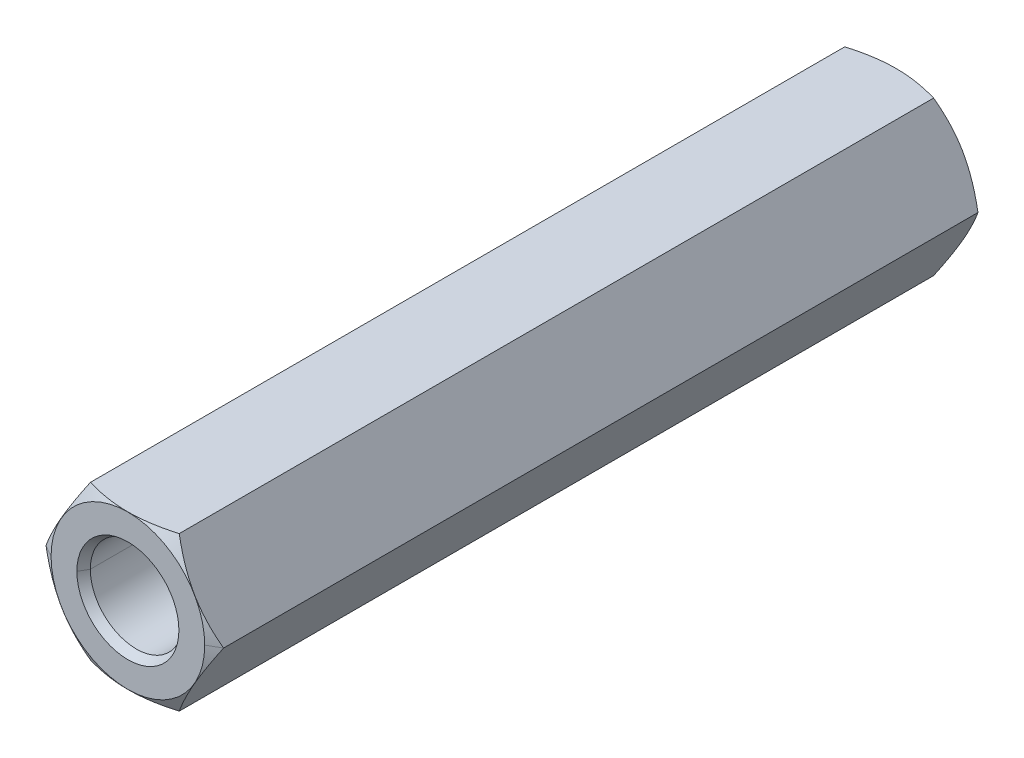
ISO-10303-21;
HEADER;
FILE_DESCRIPTION(('STEP AP214'),'2;1');
FILE_NAME('part.step','',(''),(''),'','','');
FILE_SCHEMA(('AUTOMOTIVE_DESIGN { 1 0 10303 214 1 1 1 1 }'));
ENDSEC;
DATA;
#1=APPLICATION_CONTEXT('core data for automotive mechanical design processes');
#2=APPLICATION_PROTOCOL_DEFINITION('international standard','automotive_design',2000,#1);
#3=PRODUCT_CONTEXT('',#1,'mechanical');
#4=PRODUCT('Part','Part','',(#3));
#5=PRODUCT_RELATED_PRODUCT_CATEGORY('part','',(#4));
#6=PRODUCT_DEFINITION_FORMATION('','',#4);
#7=PRODUCT_DEFINITION_CONTEXT('part definition',#1,'design');
#8=PRODUCT_DEFINITION('design','',#6,#7);
#9=PRODUCT_DEFINITION_SHAPE('','',#8);
#10=(LENGTH_UNIT() NAMED_UNIT(*) SI_UNIT(.MILLI.,.METRE.));
#11=(NAMED_UNIT(*) PLANE_ANGLE_UNIT() SI_UNIT($,.RADIAN.));
#12=(NAMED_UNIT(*) SI_UNIT($,.STERADIAN.) SOLID_ANGLE_UNIT());
#13=UNCERTAINTY_MEASURE_WITH_UNIT(LENGTH_MEASURE(1.E-05),#10,'distance_accuracy_value','');
#14=(GEOMETRIC_REPRESENTATION_CONTEXT(3) GLOBAL_UNCERTAINTY_ASSIGNED_CONTEXT((#13)) GLOBAL_UNIT_ASSIGNED_CONTEXT((#10,
#11,#12)) REPRESENTATION_CONTEXT('',''));
#15=CARTESIAN_POINT('',(0.,0.,0.));
#16=DIRECTION('',(0.,0.,1.));
#17=DIRECTION('',(1.,0.,0.));
#18=AXIS2_PLACEMENT_3D('',#15,#16,#17);
#19=CARTESIAN_POINT('',(220.318744279938,82.5620432923505,120.447608312383));
#20=DIRECTION('',(0.,0.,-1.));
#21=DIRECTION('',(1.,0.,0.));
#22=AXIS2_PLACEMENT_3D('',#19,#20,#21);
#23=CONICAL_SURFACE('',#22,1.7320508075705,1.047197551197);
#24=DIRECTION('',(0.86602540378464,0.,-0.499999999999652));
#25=VECTOR('',#24,1.);
#26=CARTESIAN_POINT('',(222.050795087508,82.5620432923505,120.447608312383));
#27=LINE('',#26,#25);
#28=CARTESIAN_POINT('',(220.318744279938,82.5620432923505,121.447608312383));
#29=VERTEX_POINT('',#28);
#30=CARTESIAN_POINT('',(221.818744279938,82.5620432923505,120.581582908599));
#31=VERTEX_POINT('',#30);
#32=EDGE_CURVE('E67',#29,#31,#27,.T.);
#33=ORIENTED_EDGE('',*,*,#32,.F.);
#34=DIRECTION('',(-0.86602540378464,0.,-0.499999999999652));
#35=VECTOR('',#34,1.);
#36=CARTESIAN_POINT('',(218.586693472367,82.5620432923505,120.447608312383));
#37=LINE('',#36,#35);
#38=CARTESIAN_POINT('',(218.818744279938,82.5620432923505,120.581582908599));
#39=VERTEX_POINT('',#38);
#40=EDGE_CURVE('E11',#29,#39,#37,.T.);
#41=ORIENTED_EDGE('',*,*,#40,.T.);
#42=CARTESIAN_POINT('',(220.318744279938,82.5620432923505,120.581582908599));
#43=DIRECTION('',(0.,0.,1.));
#44=DIRECTION('',(1.,0.,0.));
#45=AXIS2_PLACEMENT_3D('',#42,#43,#44);
#46=CIRCLE('',#45,1.5);
#47=EDGE_CURVE('E55',#31,#39,#46,.T.);
#48=ORIENTED_EDGE('',*,*,#47,.F.);
#49=EDGE_LOOP('',(#33,#41,#48));
#50=FACE_BOUND('',#49,.T.);
#51=ADVANCED_FACE('F44',(#50),#23,.F.);
#52=CARTESIAN_POINT('',(220.318744279938,82.5620432923505,120.581582908599));
#53=DIRECTION('',(0.,0.,-1.));
#54=DIRECTION('',(1.,0.,0.));
#55=AXIS2_PLACEMENT_3D('',#52,#53,#54);
#56=CYLINDRICAL_SURFACE('',#55,1.5);
#57=ORIENTED_EDGE('',*,*,#47,.T.);
#58=DIRECTION('',(0.,0.,-1.));
#59=VECTOR('',#58,1.);
#60=CARTESIAN_POINT('',(218.818744279938,82.5620432923505,120.581582908599));
#61=LINE('',#60,#59);
#62=CARTESIAN_POINT('',(218.818744279938,82.5620432923505,110.858711037809));
#63=VERTEX_POINT('',#62);
#64=EDGE_CURVE('E298',#39,#63,#61,.T.);
#65=ORIENTED_EDGE('',*,*,#64,.T.);
#66=CARTESIAN_POINT('',(220.318744279938,82.5620432923505,110.858711037809));
#67=DIRECTION('',(0.,0.,1.));
#68=DIRECTION('',(1.,0.,0.));
#69=AXIS2_PLACEMENT_3D('',#66,#67,#68);
#70=CIRCLE('',#69,1.5);
#71=CARTESIAN_POINT('',(221.818744279938,82.5620432923505,110.858711037809));
#72=VERTEX_POINT('',#71);
#73=EDGE_CURVE('E286',#72,#63,#70,.T.);
#74=ORIENTED_EDGE('',*,*,#73,.F.);
#75=DIRECTION('',(0.,0.,-1.));
#76=VECTOR('',#75,1.);
#77=CARTESIAN_POINT('',(221.818744279938,82.5620432923505,120.581582908599));
#78=LINE('',#77,#76);
#79=EDGE_CURVE('E275',#31,#72,#78,.T.);
#80=ORIENTED_EDGE('',*,*,#79,.F.);
#81=EDGE_LOOP('',(#57,#65,#74,#80));
#82=FACE_BOUND('',#81,.T.);
#83=ADVANCED_FACE('F408',(#82),#56,.F.);
#84=CARTESIAN_POINT('',(220.318744279938,82.5620432923505,110.858711037809));
#85=DIRECTION('',(0.,0.,-1.));
#86=DIRECTION('',(1.,0.,0.));
#87=AXIS2_PLACEMENT_3D('',#84,#85,#86);
#88=CONICAL_SURFACE('',#87,1.5,0.5235987756);
#89=ORIENTED_EDGE('',*,*,#73,.T.);
#90=DIRECTION('',(-0.500000000001473,0.,-0.866025403783588));
#91=VECTOR('',#90,1.);
#92=CARTESIAN_POINT('',(218.818744279938,82.5620432923505,110.858711037809));
#93=LINE('',#92,#91);
#94=CARTESIAN_POINT('',(218.658744279937,82.5620432923505,110.581582908599));
#95=VERTEX_POINT('',#94);
#96=EDGE_CURVE('E282',#63,#95,#93,.T.);
#97=ORIENTED_EDGE('',*,*,#96,.T.);
#98=CARTESIAN_POINT('',(220.318744279938,82.5620432923505,110.581582908599));
#99=DIRECTION('',(0.,0.,1.));
#100=DIRECTION('',(1.,0.,0.));
#101=AXIS2_PLACEMENT_3D('',#98,#99,#100);
#102=CIRCLE('',#101,1.66);
#103=CARTESIAN_POINT('',(221.978744279938,82.5620432923505,110.581582908599));
#104=VERTEX_POINT('',#103);
#105=EDGE_CURVE('E280',#104,#95,#102,.T.);
#106=ORIENTED_EDGE('',*,*,#105,.F.);
#107=DIRECTION('',(0.500000000001473,0.,-0.866025403783588));
#108=VECTOR('',#107,1.);
#109=CARTESIAN_POINT('',(221.818744279938,82.5620432923505,110.858711037809));
#110=LINE('',#109,#108);
#111=EDGE_CURVE('E274',#72,#104,#110,.T.);
#112=ORIENTED_EDGE('',*,*,#111,.F.);
#113=EDGE_LOOP('',(#89,#97,#106,#112));
#114=FACE_BOUND('',#113,.T.);
#115=ADVANCED_FACE('F413',(#114),#88,.F.);
#116=CARTESIAN_POINT('',(220.318744279938,82.5620432923505,110.581582908599));
#117=DIRECTION('',(0.,0.,1.));
#118=DIRECTION('',(1.,0.,0.));
#119=AXIS2_PLACEMENT_3D('',#116,#117,#118);
#120=CONICAL_SURFACE('',#119,2.5,1.047197551197);
#121=CARTESIAN_POINT('',(220.318744279938,82.5620432923505,110.581582908599));
#122=DIRECTION('',(0.,0.,1.));
#123=DIRECTION('',(1.,0.,0.));
#124=AXIS2_PLACEMENT_3D('',#121,#122,#123);
#125=CIRCLE('',#124,2.5);
#126=CARTESIAN_POINT('',(222.818744279938,82.5620432923505,110.581582908599));
#127=VERTEX_POINT('',#126);
#128=CARTESIAN_POINT('',(217.818744279938,82.5620432923505,110.581582908599));
#129=VERTEX_POINT('',#128);
#130=EDGE_CURVE('E287',#127,#129,#125,.T.);
#131=ORIENTED_EDGE('',*,*,#130,.T.);
#132=DIRECTION('',(-0.86602540378464,0.,0.499999999999652));
#133=VECTOR('',#132,1.);
#134=CARTESIAN_POINT('',(217.818744279938,82.5620432923505,110.581582908599));
#135=LINE('',#134,#133);
#136=CARTESIAN_POINT('',(217.428744279937,82.5620432923504,110.806749513583));
#137=VERTEX_POINT('',#136);
#138=EDGE_CURVE('E48',#129,#137,#135,.T.);
#139=ORIENTED_EDGE('',*,*,#138,.T.);
#140=CARTESIAN_POINT('',(218.873744279938,85.0648567092874,110.806749513583));
#141=CARTESIAN_POINT('',(218.151244279938,83.8134500008193,110.389613944093));
#142=CARTESIAN_POINT('',(217.428744279937,82.5620432923504,110.806749513583));
#143=(BOUNDED_CURVE() B_SPLINE_CURVE(2,(#140,#141,#142),.UNSPECIFIED.,.F.,
.F.) B_SPLINE_CURVE_WITH_KNOTS((3,3),(0.,1.),
.UNSPECIFIED.) CURVE() GEOMETRIC_REPRESENTATION_ITEM() RATIONAL_B_SPLINE_CURVE((1.,
1.15470053837935,1.)) REPRESENTATION_ITEM(''));
#144=CARTESIAN_POINT('',(218.873744279938,85.0648567092874,110.806749513583));
#145=VERTEX_POINT('',#144);
#146=EDGE_CURVE('E222',#145,#137,#143,.T.);
#147=ORIENTED_EDGE('',*,*,#146,.F.);
#148=CARTESIAN_POINT('',(221.763744279937,85.0648567092874,110.806749513583));
#149=CARTESIAN_POINT('',(220.318744279938,85.0648567092874,110.389613944093));
#150=CARTESIAN_POINT('',(218.873744279938,85.0648567092874,110.806749513583));
#151=(BOUNDED_CURVE() B_SPLINE_CURVE(2,(#148,#149,#150),.UNSPECIFIED.,.F.,
.F.) B_SPLINE_CURVE_WITH_KNOTS((3,3),(0.,1.),
.UNSPECIFIED.) CURVE() GEOMETRIC_REPRESENTATION_ITEM() RATIONAL_B_SPLINE_CURVE((1.,
1.15470053837926,1.)) REPRESENTATION_ITEM(''));
#152=CARTESIAN_POINT('',(221.763744279937,85.0648567092874,110.806749513583));
#153=VERTEX_POINT('',#152);
#154=EDGE_CURVE('E240',#153,#145,#151,.T.);
#155=ORIENTED_EDGE('',*,*,#154,.F.);
#156=CARTESIAN_POINT('',(223.208744279937,82.5620432923505,110.806749513583));
#157=CARTESIAN_POINT('',(222.486244279938,83.8134500008188,110.389613944093));
#158=CARTESIAN_POINT('',(221.763744279937,85.0648567092874,110.806749513583));
#159=(BOUNDED_CURVE() B_SPLINE_CURVE(2,(#156,#157,#158),.UNSPECIFIED.,.F.,
.F.) B_SPLINE_CURVE_WITH_KNOTS((3,3),(0.,1.),
.UNSPECIFIED.) CURVE() GEOMETRIC_REPRESENTATION_ITEM() RATIONAL_B_SPLINE_CURVE((1.,
1.15470053837946,1.)) REPRESENTATION_ITEM(''));
#160=CARTESIAN_POINT('',(223.208744279937,82.5620432923505,110.806749513583));
#161=VERTEX_POINT('',#160);
#162=EDGE_CURVE('E316',#161,#153,#159,.T.);
#163=ORIENTED_EDGE('',*,*,#162,.F.);
#164=DIRECTION('',(0.86602540378464,0.,0.499999999999652));
#165=VECTOR('',#164,1.);
#166=CARTESIAN_POINT('',(222.818744279938,82.5620432923505,110.581582908599));
#167=LINE('',#166,#165);
#168=EDGE_CURVE('E337',#127,#161,#167,.T.);
#169=ORIENTED_EDGE('',*,*,#168,.F.);
#170=EDGE_LOOP('',(#131,#139,#147,#155,#163,#169));
#171=FACE_BOUND('',#170,.T.);
#172=ADVANCED_FACE('F420',(#171),#120,.T.);
#173=CARTESIAN_POINT('',(220.318744279938,82.5620432923505,135.356416303615));
#174=DIRECTION('',(0.,0.,-1.));
#175=DIRECTION('',(1.,0.,0.));
#176=AXIS2_PLACEMENT_3D('',#173,#174,#175);
#177=CONICAL_SURFACE('',#176,2.89,1.047197551197);
#178=CARTESIAN_POINT('',(220.318744279938,82.5620432923505,135.581582908599));
#179=DIRECTION('',(0.,0.,1.));
#180=DIRECTION('',(1.,0.,0.));
#181=AXIS2_PLACEMENT_3D('',#178,#179,#180);
#182=CIRCLE('',#181,2.5);
#183=CARTESIAN_POINT('',(217.818744279938,82.5620432923505,135.581582908599));
#184=VERTEX_POINT('',#183);
#185=CARTESIAN_POINT('',(222.818744279938,82.5620432923505,135.581582908599));
#186=VERTEX_POINT('',#185);
#187=EDGE_CURVE('E144',#184,#186,#182,.T.);
#188=ORIENTED_EDGE('',*,*,#187,.F.);
#189=DIRECTION('',(-0.86602540378464,0.,-0.499999999999652));
#190=VECTOR('',#189,1.);
#191=CARTESIAN_POINT('',(217.428744279937,82.5620432923505,135.356416303615));
#192=LINE('',#191,#190);
#193=CARTESIAN_POINT('',(217.428744279937,82.5620432923505,135.356416303615));
#194=VERTEX_POINT('',#193);
#195=EDGE_CURVE('E357',#184,#194,#192,.T.);
#196=ORIENTED_EDGE('',*,*,#195,.T.);
#197=CARTESIAN_POINT('',(218.873744279938,80.0592298754134,135.356416303615));
#198=CARTESIAN_POINT('',(218.151244279937,81.3106365838815,135.773551873104));
#199=CARTESIAN_POINT('',(217.428744279937,82.5620432923505,135.356416303615));
#200=(BOUNDED_CURVE() B_SPLINE_CURVE(2,(#197,#198,#199),.UNSPECIFIED.,.F.,
.F.) B_SPLINE_CURVE_WITH_KNOTS((3,3),(0.,1.),
.UNSPECIFIED.) CURVE() GEOMETRIC_REPRESENTATION_ITEM() RATIONAL_B_SPLINE_CURVE((1.,
1.15470053837936,1.)) REPRESENTATION_ITEM(''));
#201=CARTESIAN_POINT('',(218.873744279938,80.0592298754134,135.356416303615));
#202=VERTEX_POINT('',#201);
#203=EDGE_CURVE('E324',#202,#194,#200,.T.);
#204=ORIENTED_EDGE('',*,*,#203,.F.);
#205=CARTESIAN_POINT('',(221.763744279937,80.0592298754134,135.356416303615));
#206=CARTESIAN_POINT('',(220.318744279938,80.0592298754134,135.773551873104));
#207=CARTESIAN_POINT('',(218.873744279938,80.0592298754134,135.356416303615));
#208=(BOUNDED_CURVE() B_SPLINE_CURVE(2,(#205,#206,#207),.UNSPECIFIED.,.F.,
.F.) B_SPLINE_CURVE_WITH_KNOTS((3,3),(0.,1.),
.UNSPECIFIED.) CURVE() GEOMETRIC_REPRESENTATION_ITEM() RATIONAL_B_SPLINE_CURVE((1.,
1.15470053837925,1.)) REPRESENTATION_ITEM(''));
#209=CARTESIAN_POINT('',(221.763744279937,80.0592298754134,135.356416303615));
#210=VERTEX_POINT('',#209);
#211=EDGE_CURVE('E249',#210,#202,#208,.T.);
#212=ORIENTED_EDGE('',*,*,#211,.F.);
#213=CARTESIAN_POINT('',(223.208744279937,82.5620432923505,135.356416303615));
#214=CARTESIAN_POINT('',(222.486244279938,81.3106365838821,135.773551873104));
#215=CARTESIAN_POINT('',(221.763744279937,80.0592298754134,135.356416303615));
#216=(BOUNDED_CURVE() B_SPLINE_CURVE(2,(#213,#214,#215),.UNSPECIFIED.,.F.,
.F.) B_SPLINE_CURVE_WITH_KNOTS((3,3),(0.,1.),
.UNSPECIFIED.) CURVE() GEOMETRIC_REPRESENTATION_ITEM() RATIONAL_B_SPLINE_CURVE((1.,
1.15470053837944,1.)) REPRESENTATION_ITEM(''));
#217=CARTESIAN_POINT('',(223.208744279937,82.5620432923505,135.356416303615));
#218=VERTEX_POINT('',#217);
#219=EDGE_CURVE('E238',#218,#210,#216,.T.);
#220=ORIENTED_EDGE('',*,*,#219,.F.);
#221=DIRECTION('',(0.86602540378464,0.,-0.499999999999652));
#222=VECTOR('',#221,1.);
#223=CARTESIAN_POINT('',(223.208744279937,82.5620432923505,135.356416303615));
#224=LINE('',#223,#222);
#225=EDGE_CURVE('E217',#186,#218,#224,.T.);
#226=ORIENTED_EDGE('',*,*,#225,.F.);
#227=EDGE_LOOP('',(#188,#196,#204,#212,#220,#226));
#228=FACE_BOUND('',#227,.T.);
#229=ADVANCED_FACE('F423',(#228),#177,.T.);
#230=CARTESIAN_POINT('',(220.318744279938,82.5620432923505,135.581582908599));
#231=DIRECTION('',(0.,0.,1.));
#232=DIRECTION('',(1.,0.,0.));
#233=AXIS2_PLACEMENT_3D('',#230,#231,#232);
#234=CONICAL_SURFACE('',#233,1.65999999999899,0.523598775598);
#235=CARTESIAN_POINT('',(220.318744279938,82.5620432923505,135.304454779389));
#236=DIRECTION('',(0.,0.,1.));
#237=DIRECTION('',(1.,0.,0.));
#238=AXIS2_PLACEMENT_3D('',#235,#236,#237);
#239=CIRCLE('',#238,1.5);
#240=CARTESIAN_POINT('',(218.818744279938,82.5620432923505,135.304454779389));
#241=VERTEX_POINT('',#240);
#242=CARTESIAN_POINT('',(221.818744279938,82.5620432923505,135.304454779389));
#243=VERTEX_POINT('',#242);
#244=EDGE_CURVE('E187',#241,#243,#239,.T.);
#245=ORIENTED_EDGE('',*,*,#244,.F.);
#246=DIRECTION('',(-0.499999999999741,0.,0.866025403784588));
#247=VECTOR('',#246,1.);
#248=CARTESIAN_POINT('',(218.658744279938,82.5620432923505,135.581582908599));
#249=LINE('',#248,#247);
#250=CARTESIAN_POINT('',(218.658744279938,82.5620432923505,135.581582908599));
#251=VERTEX_POINT('',#250);
#252=EDGE_CURVE('E354',#241,#251,#249,.T.);
#253=ORIENTED_EDGE('',*,*,#252,.T.);
#254=CARTESIAN_POINT('',(220.318744279938,82.5620432923505,135.581582908599));
#255=DIRECTION('',(0.,0.,1.));
#256=DIRECTION('',(1.,0.,0.));
#257=AXIS2_PLACEMENT_3D('',#254,#255,#256);
#258=CIRCLE('',#257,1.65999999999899);
#259=CARTESIAN_POINT('',(221.978744279937,82.5620432923505,135.581582908599));
#260=VERTEX_POINT('',#259);
#261=EDGE_CURVE('E310',#251,#260,#258,.T.);
#262=ORIENTED_EDGE('',*,*,#261,.T.);
#263=DIRECTION('',(0.499999999999741,0.,0.866025403784588));
#264=VECTOR('',#263,1.);
#265=CARTESIAN_POINT('',(221.978744279937,82.5620432923505,135.581582908599));
#266=LINE('',#265,#264);
#267=EDGE_CURVE('E367',#243,#260,#266,.T.);
#268=ORIENTED_EDGE('',*,*,#267,.F.);
#269=EDGE_LOOP('',(#245,#253,#262,#268));
#270=FACE_BOUND('',#269,.T.);
#271=ADVANCED_FACE('F390',(#270),#234,.F.);
#272=CARTESIAN_POINT('',(220.318744279938,82.5620432923505,135.304454779389));
#273=DIRECTION('',(0.,0.,-1.));
#274=DIRECTION('',(1.,0.,0.));
#275=AXIS2_PLACEMENT_3D('',#272,#273,#274);
#276=CYLINDRICAL_SURFACE('',#275,1.5);
#277=CARTESIAN_POINT('',(220.318744279938,82.5620432923505,135.304454779389));
#278=DIRECTION('',(0.,0.,1.));
#279=DIRECTION('',(1.,0.,0.));
#280=AXIS2_PLACEMENT_3D('',#277,#278,#279);
#281=CIRCLE('',#280,1.5);
#282=EDGE_CURVE('E199',#243,#241,#281,.T.);
#283=ORIENTED_EDGE('',*,*,#282,.T.);
#284=DIRECTION('',(0.,0.,-1.));
#285=VECTOR('',#284,1.);
#286=CARTESIAN_POINT('',(218.818744279938,82.5620432923505,135.304454779389));
#287=LINE('',#286,#285);
#288=CARTESIAN_POINT('',(218.818744279938,82.5620432923505,125.581582908599));
#289=VERTEX_POINT('',#288);
#290=EDGE_CURVE('E193',#241,#289,#287,.T.);
#291=ORIENTED_EDGE('',*,*,#290,.T.);
#292=CARTESIAN_POINT('',(220.318744279938,82.5620432923505,125.581582908599));
#293=DIRECTION('',(0.,0.,1.));
#294=DIRECTION('',(1.,0.,0.));
#295=AXIS2_PLACEMENT_3D('',#292,#293,#294);
#296=CIRCLE('',#295,1.5);
#297=CARTESIAN_POINT('',(221.818744279938,82.5620432923505,125.581582908599));
#298=VERTEX_POINT('',#297);
#299=EDGE_CURVE('E177',#298,#289,#296,.T.);
#300=ORIENTED_EDGE('',*,*,#299,.F.);
#301=DIRECTION('',(0.,0.,-1.));
#302=VECTOR('',#301,1.);
#303=CARTESIAN_POINT('',(221.818744279938,82.5620432923505,135.304454779389));
#304=LINE('',#303,#302);
#305=EDGE_CURVE('E206',#243,#298,#304,.T.);
#306=ORIENTED_EDGE('',*,*,#305,.F.);
#307=EDGE_LOOP('',(#283,#291,#300,#306));
#308=FACE_BOUND('',#307,.T.);
#309=ADVANCED_FACE('F197',(#308),#276,.F.);
#310=CARTESIAN_POINT('',(220.318744279938,82.5620432923505,125.581582908599));
#311=DIRECTION('',(0.,0.,1.));
#312=DIRECTION('',(1.,0.,0.));
#313=AXIS2_PLACEMENT_3D('',#310,#311,#312);
#314=CONICAL_SURFACE('',#313,1.5,1.047197551197);
#315=DIRECTION('',(0.86602540378464,0.,0.499999999999652));
#316=VECTOR('',#315,1.);
#317=CARTESIAN_POINT('',(221.818744279938,82.5620432923505,125.581582908599));
#318=LINE('',#317,#316);
#319=CARTESIAN_POINT('',(220.318744279938,82.5620432923505,124.715557504814));
#320=VERTEX_POINT('',#319);
#321=EDGE_CURVE('E181',#320,#298,#318,.T.);
#322=ORIENTED_EDGE('',*,*,#321,.F.);
#323=DIRECTION('',(-0.86602540378464,0.,0.499999999999652));
#324=VECTOR('',#323,1.);
#325=CARTESIAN_POINT('',(218.818744279938,82.5620432923505,125.581582908599));
#326=LINE('',#325,#324);
#327=EDGE_CURVE('E180',#320,#289,#326,.T.);
#328=ORIENTED_EDGE('',*,*,#327,.T.);
#329=CARTESIAN_POINT('',(220.318744279938,82.5620432923505,125.581582908599));
#330=DIRECTION('',(0.,0.,1.));
#331=DIRECTION('',(1.,0.,0.));
#332=AXIS2_PLACEMENT_3D('',#329,#330,#331);
#333=CIRCLE('',#332,1.5);
#334=EDGE_CURVE('E191',#289,#298,#333,.T.);
#335=ORIENTED_EDGE('',*,*,#334,.T.);
#336=EDGE_LOOP('',(#322,#328,#335));
#337=FACE_BOUND('',#336,.T.);
#338=ADVANCED_FACE('F46',(#337),#314,.F.);
#339=CARTESIAN_POINT('',(220.318744279938,82.5620432923505,125.581582908599));
#340=DIRECTION('',(0.,0.,1.));
#341=DIRECTION('',(1.,0.,0.));
#342=AXIS2_PLACEMENT_3D('',#339,#340,#341);
#343=CONICAL_SURFACE('',#342,1.5,1.047197551197);
#344=ORIENTED_EDGE('',*,*,#327,.F.);
#345=ORIENTED_EDGE('',*,*,#321,.T.);
#346=ORIENTED_EDGE('',*,*,#299,.T.);
#347=EDGE_LOOP('',(#344,#345,#346));
#348=FACE_BOUND('',#347,.T.);
#349=ADVANCED_FACE('F179',(#348),#343,.F.);
#350=CARTESIAN_POINT('',(220.318744279938,82.5620432923505,135.304454779389));
#351=DIRECTION('',(0.,0.,-1.));
#352=DIRECTION('',(1.,0.,0.));
#353=AXIS2_PLACEMENT_3D('',#350,#351,#352);
#354=CYLINDRICAL_SURFACE('',#353,1.5);
#355=ORIENTED_EDGE('',*,*,#290,.F.);
#356=ORIENTED_EDGE('',*,*,#244,.T.);
#357=ORIENTED_EDGE('',*,*,#305,.T.);
#358=ORIENTED_EDGE('',*,*,#334,.F.);
#359=EDGE_LOOP('',(#355,#356,#357,#358));
#360=FACE_BOUND('',#359,.T.);
#361=ADVANCED_FACE('F205',(#360),#354,.F.);
#362=CARTESIAN_POINT('',(220.318744279938,82.5620432923505,135.581582908599));
#363=DIRECTION('',(0.,0.,1.));
#364=DIRECTION('',(1.,0.,0.));
#365=AXIS2_PLACEMENT_3D('',#362,#363,#364);
#366=CONICAL_SURFACE('',#365,1.65999999999899,0.523598775598);
#367=ORIENTED_EDGE('',*,*,#252,.F.);
#368=ORIENTED_EDGE('',*,*,#282,.F.);
#369=ORIENTED_EDGE('',*,*,#267,.T.);
#370=CARTESIAN_POINT('',(220.318744279938,82.5620432923505,135.581582908599));
#371=DIRECTION('',(0.,0.,1.));
#372=DIRECTION('',(1.,0.,0.));
#373=AXIS2_PLACEMENT_3D('',#370,#371,#372);
#374=CIRCLE('',#373,1.65999999999899);
#375=EDGE_CURVE('E264',#260,#251,#374,.T.);
#376=ORIENTED_EDGE('',*,*,#375,.T.);
#377=EDGE_LOOP('',(#367,#368,#369,#376));
#378=FACE_BOUND('',#377,.T.);
#379=ADVANCED_FACE('F384',(#378),#366,.F.);
#380=CARTESIAN_POINT('',(220.318744279938,82.5620432923505,135.581582908599));
#381=DIRECTION('',(0.,0.,1.));
#382=DIRECTION('',(1.,0.,0.));
#383=AXIS2_PLACEMENT_3D('',#380,#381,#382);
#384=PLANE('',#383);
#385=CARTESIAN_POINT('',(220.318744279938,82.5620432923505,135.581582908599));
#386=DIRECTION('',(0.,0.,1.));
#387=DIRECTION('',(1.,0.,0.));
#388=AXIS2_PLACEMENT_3D('',#385,#386,#387);
#389=CIRCLE('',#388,2.5);
#390=EDGE_CURVE('E216',#186,#184,#389,.T.);
#391=ORIENTED_EDGE('',*,*,#390,.T.);
#392=ORIENTED_EDGE('',*,*,#187,.T.);
#393=EDGE_LOOP('',(#391,#392));
#394=FACE_BOUND('',#393,.T.);
#395=ORIENTED_EDGE('',*,*,#375,.F.);
#396=ORIENTED_EDGE('',*,*,#261,.F.);
#397=EDGE_LOOP('',(#395,#396));
#398=FACE_BOUND('',#397,.T.);
#399=ADVANCED_FACE('F394',(#394,#398),#384,.T.);
#400=CARTESIAN_POINT('',(220.318744279938,82.5620432923505,135.356416303615));
#401=DIRECTION('',(0.,0.,-1.));
#402=DIRECTION('',(1.,0.,0.));
#403=AXIS2_PLACEMENT_3D('',#400,#401,#402);
#404=CONICAL_SURFACE('',#403,2.89,1.047197551197);
#405=ORIENTED_EDGE('',*,*,#195,.F.);
#406=ORIENTED_EDGE('',*,*,#390,.F.);
#407=ORIENTED_EDGE('',*,*,#225,.T.);
#408=CARTESIAN_POINT('',(221.763744279937,85.0648567092874,135.356416303615));
#409=CARTESIAN_POINT('',(222.486244279938,83.8134500008193,135.773551873104));
#410=CARTESIAN_POINT('',(223.208744279937,82.5620432923505,135.356416303615));
#411=(BOUNDED_CURVE() B_SPLINE_CURVE(2,(#408,#409,#410),.UNSPECIFIED.,.F.,
.F.) B_SPLINE_CURVE_WITH_KNOTS((3,3),(0.,1.),
.UNSPECIFIED.) CURVE() GEOMETRIC_REPRESENTATION_ITEM() RATIONAL_B_SPLINE_CURVE((1.,
1.15470053837935,1.)) REPRESENTATION_ITEM(''));
#412=CARTESIAN_POINT('',(221.763744279937,85.0648567092874,135.356416303615));
#413=VERTEX_POINT('',#412);
#414=EDGE_CURVE('E294',#413,#218,#411,.T.);
#415=ORIENTED_EDGE('',*,*,#414,.F.);
#416=CARTESIAN_POINT('',(218.873744279938,85.0648567092874,135.356416303615));
#417=CARTESIAN_POINT('',(220.318744279937,85.0648567092874,135.773551873104));
#418=CARTESIAN_POINT('',(221.763744279937,85.0648567092874,135.356416303615));
#419=(BOUNDED_CURVE() B_SPLINE_CURVE(2,(#416,#417,#418),.UNSPECIFIED.,.F.,
.F.) B_SPLINE_CURVE_WITH_KNOTS((3,3),(0.,1.),
.UNSPECIFIED.) CURVE() GEOMETRIC_REPRESENTATION_ITEM() RATIONAL_B_SPLINE_CURVE((1.,
1.15470053837925,1.)) REPRESENTATION_ITEM(''));
#420=CARTESIAN_POINT('',(218.873744279938,85.0648567092874,135.356416303615));
#421=VERTEX_POINT('',#420);
#422=EDGE_CURVE('E223',#421,#413,#419,.T.);
#423=ORIENTED_EDGE('',*,*,#422,.F.);
#424=CARTESIAN_POINT('',(217.428744279937,82.5620432923505,135.356416303615));
#425=CARTESIAN_POINT('',(218.151244279937,83.8134500008188,135.773551873104));
#426=CARTESIAN_POINT('',(218.873744279938,85.0648567092874,135.356416303615));
#427=(BOUNDED_CURVE() B_SPLINE_CURVE(2,(#424,#425,#426),.UNSPECIFIED.,.F.,
.F.) B_SPLINE_CURVE_WITH_KNOTS((3,3),(0.,1.),
.UNSPECIFIED.) CURVE() GEOMETRIC_REPRESENTATION_ITEM() RATIONAL_B_SPLINE_CURVE((1.,
1.15470053837944,1.)) REPRESENTATION_ITEM(''));
#428=EDGE_CURVE('E132',#194,#421,#427,.T.);
#429=ORIENTED_EDGE('',*,*,#428,.F.);
#430=EDGE_LOOP('',(#405,#406,#407,#415,#423,#429));
#431=FACE_BOUND('',#430,.T.);
#432=ADVANCED_FACE('F396',(#431),#404,.T.);
#433=CARTESIAN_POINT('',(221.763744279937,80.0592298754134,110.581582908599));
#434=DIRECTION('',(-0.866025403784329,0.50000000000019,0.));
#435=DIRECTION('',(0.,0.,1.));
#436=AXIS2_PLACEMENT_3D('',#433,#434,#435);
#437=PLANE('',#436);
#438=DIRECTION('',(0.,0.,1.));
#439=VECTOR('',#438,1.);
#440=CARTESIAN_POINT('',(223.208744279937,82.5620432923505,110.806749513583));
#441=LINE('',#440,#439);
#442=EDGE_CURVE('E266',#161,#218,#441,.T.);
#443=ORIENTED_EDGE('',*,*,#442,.T.);
#444=ORIENTED_EDGE('',*,*,#219,.T.);
#445=DIRECTION('',(0.,0.,1.));
#446=VECTOR('',#445,1.);
#447=CARTESIAN_POINT('',(221.763744279937,80.0592298754134,110.581582908599));
#448=LINE('',#447,#446);
#449=CARTESIAN_POINT('',(221.763744279937,80.0592298754134,110.806749513583));
#450=VERTEX_POINT('',#449);
#451=EDGE_CURVE('E239',#450,#210,#448,.T.);
#452=ORIENTED_EDGE('',*,*,#451,.F.);
#453=CARTESIAN_POINT('',(221.763744279937,80.0592298754134,110.806749513583));
#454=CARTESIAN_POINT('',(222.486244279938,81.3106365838816,110.389613944093));
#455=CARTESIAN_POINT('',(223.208744279937,82.5620432923505,110.806749513583));
#456=(BOUNDED_CURVE() B_SPLINE_CURVE(2,(#453,#454,#455),.UNSPECIFIED.,.F.,
.F.) B_SPLINE_CURVE_WITH_KNOTS((3,3),(0.,1.),
.UNSPECIFIED.) CURVE() GEOMETRIC_REPRESENTATION_ITEM() RATIONAL_B_SPLINE_CURVE((1.,
1.15470053837935,1.)) REPRESENTATION_ITEM(''));
#457=EDGE_CURVE('E229',#450,#161,#456,.T.);
#458=ORIENTED_EDGE('',*,*,#457,.T.);
#459=EDGE_LOOP('',(#443,#444,#452,#458));
#460=FACE_BOUND('',#459,.T.);
#461=ADVANCED_FACE('F403',(#460),#437,.F.);
#462=CARTESIAN_POINT('',(218.873744279938,80.0592298754134,110.581582908599));
#463=DIRECTION('',(0.,1.,0.));
#464=DIRECTION('',(1.,0.,0.));
#465=AXIS2_PLACEMENT_3D('',#462,#463,#464);
#466=PLANE('',#465);
#467=ORIENTED_EDGE('',*,*,#451,.T.);
#468=ORIENTED_EDGE('',*,*,#211,.T.);
#469=DIRECTION('',(0.,0.,1.));
#470=VECTOR('',#469,1.);
#471=CARTESIAN_POINT('',(218.873744279938,80.0592298754134,110.581582908599));
#472=LINE('',#471,#470);
#473=CARTESIAN_POINT('',(218.873744279938,80.0592298754134,110.806749513583));
#474=VERTEX_POINT('',#473);
#475=EDGE_CURVE('E317',#474,#202,#472,.T.);
#476=ORIENTED_EDGE('',*,*,#475,.F.);
#477=CARTESIAN_POINT('',(218.873744279938,80.0592298754134,110.806749513583));
#478=CARTESIAN_POINT('',(220.318744279938,80.0592298754134,110.389613944093));
#479=CARTESIAN_POINT('',(221.763744279937,80.0592298754134,110.806749513583));
#480=(BOUNDED_CURVE() B_SPLINE_CURVE(2,(#477,#478,#479),.UNSPECIFIED.,.F.,
.F.) B_SPLINE_CURVE_WITH_KNOTS((3,3),(0.,1.),
.UNSPECIFIED.) CURVE() GEOMETRIC_REPRESENTATION_ITEM() RATIONAL_B_SPLINE_CURVE((1.,
1.15470053837926,1.)) REPRESENTATION_ITEM(''));
#481=EDGE_CURVE('E258',#474,#450,#480,.T.);
#482=ORIENTED_EDGE('',*,*,#481,.T.);
#483=EDGE_LOOP('',(#467,#468,#476,#482));
#484=FACE_BOUND('',#483,.T.);
#485=ADVANCED_FACE('F455',(#484),#466,.F.);
#486=CARTESIAN_POINT('',(217.428744279937,82.5620432923505,110.581582908599));
#487=DIRECTION('',(0.866025403784329,0.50000000000019,0.));
#488=DIRECTION('',(0.,0.,-1.));
#489=AXIS2_PLACEMENT_3D('',#486,#487,#488);
#490=PLANE('',#489);
#491=ORIENTED_EDGE('',*,*,#475,.T.);
#492=ORIENTED_EDGE('',*,*,#203,.T.);
#493=DIRECTION('',(0.,0.,1.));
#494=VECTOR('',#493,1.);
#495=CARTESIAN_POINT('',(217.428744279937,82.5620432923505,110.581582908599));
#496=LINE('',#495,#494);
#497=EDGE_CURVE('E228',#137,#194,#496,.T.);
#498=ORIENTED_EDGE('',*,*,#497,.F.);
#499=CARTESIAN_POINT('',(217.428744279937,82.5620432923504,110.806749513583));
#500=CARTESIAN_POINT('',(218.151244279937,81.3106365838821,110.389613944093));
#501=CARTESIAN_POINT('',(218.873744279938,80.0592298754134,110.806749513583));
#502=(BOUNDED_CURVE() B_SPLINE_CURVE(2,(#499,#500,#501),.UNSPECIFIED.,.F.,
.F.) B_SPLINE_CURVE_WITH_KNOTS((3,3),(0.,1.),
.UNSPECIFIED.) CURVE() GEOMETRIC_REPRESENTATION_ITEM() RATIONAL_B_SPLINE_CURVE((1.,
1.15470053837945,1.)) REPRESENTATION_ITEM(''));
#503=EDGE_CURVE('E364',#137,#474,#502,.T.);
#504=ORIENTED_EDGE('',*,*,#503,.T.);
#505=EDGE_LOOP('',(#491,#492,#498,#504));
#506=FACE_BOUND('',#505,.T.);
#507=ADVANCED_FACE('F451',(#506),#490,.F.);
#508=CARTESIAN_POINT('',(218.873744279938,85.0648567092874,110.581582908599));
#509=DIRECTION('',(0.866025403784329,-0.50000000000019,0.));
#510=DIRECTION('',(0.,0.,-1.));
#511=AXIS2_PLACEMENT_3D('',#508,#509,#510);
#512=PLANE('',#511);
#513=ORIENTED_EDGE('',*,*,#497,.T.);
#514=ORIENTED_EDGE('',*,*,#428,.T.);
#515=DIRECTION('',(0.,0.,1.));
#516=VECTOR('',#515,1.);
#517=CARTESIAN_POINT('',(218.873744279938,85.0648567092874,110.581582908599));
#518=LINE('',#517,#516);
#519=EDGE_CURVE('E218',#145,#421,#518,.T.);
#520=ORIENTED_EDGE('',*,*,#519,.F.);
#521=ORIENTED_EDGE('',*,*,#146,.T.);
#522=EDGE_LOOP('',(#513,#514,#520,#521));
#523=FACE_BOUND('',#522,.T.);
#524=ADVANCED_FACE('F454',(#523),#512,.F.);
#525=CARTESIAN_POINT('',(221.763744279937,85.0648567092874,110.581582908599));
#526=DIRECTION('',(0.,-1.,0.));
#527=DIRECTION('',(-1.,0.,0.));
#528=AXIS2_PLACEMENT_3D('',#525,#526,#527);
#529=PLANE('',#528);
#530=ORIENTED_EDGE('',*,*,#519,.T.);
#531=ORIENTED_EDGE('',*,*,#422,.T.);
#532=DIRECTION('',(0.,0.,1.));
#533=VECTOR('',#532,1.);
#534=CARTESIAN_POINT('',(221.763744279937,85.0648567092874,110.581582908599));
#535=LINE('',#534,#533);
#536=EDGE_CURVE('E248',#153,#413,#535,.T.);
#537=ORIENTED_EDGE('',*,*,#536,.F.);
#538=ORIENTED_EDGE('',*,*,#154,.T.);
#539=EDGE_LOOP('',(#530,#531,#537,#538));
#540=FACE_BOUND('',#539,.T.);
#541=ADVANCED_FACE('F449',(#540),#529,.F.);
#542=CARTESIAN_POINT('',(223.208744279937,82.5620432923505,110.581582908599));
#543=DIRECTION('',(-0.866025403784329,-0.50000000000019,0.));
#544=DIRECTION('',(-0.50000000000019,0.866025403784329,0.));
#545=AXIS2_PLACEMENT_3D('',#542,#543,#544);
#546=PLANE('',#545);
#547=ORIENTED_EDGE('',*,*,#536,.T.);
#548=ORIENTED_EDGE('',*,*,#414,.T.);
#549=ORIENTED_EDGE('',*,*,#442,.F.);
#550=ORIENTED_EDGE('',*,*,#162,.T.);
#551=EDGE_LOOP('',(#547,#548,#549,#550));
#552=FACE_BOUND('',#551,.T.);
#553=ADVANCED_FACE('F446',(#552),#546,.F.);
#554=CARTESIAN_POINT('',(220.318744279938,82.5620432923505,110.581582908599));
#555=DIRECTION('',(0.,0.,1.));
#556=DIRECTION('',(1.,0.,0.));
#557=AXIS2_PLACEMENT_3D('',#554,#555,#556);
#558=CONICAL_SURFACE('',#557,2.5,1.047197551197);
#559=ORIENTED_EDGE('',*,*,#138,.F.);
#560=CARTESIAN_POINT('',(220.318744279938,82.5620432923505,110.581582908599));
#561=DIRECTION('',(0.,0.,1.));
#562=DIRECTION('',(1.,0.,0.));
#563=AXIS2_PLACEMENT_3D('',#560,#561,#562);
#564=CIRCLE('',#563,2.5);
#565=EDGE_CURVE('E330',#129,#127,#564,.T.);
#566=ORIENTED_EDGE('',*,*,#565,.T.);
#567=ORIENTED_EDGE('',*,*,#168,.T.);
#568=ORIENTED_EDGE('',*,*,#457,.F.);
#569=ORIENTED_EDGE('',*,*,#481,.F.);
#570=ORIENTED_EDGE('',*,*,#503,.F.);
#571=EDGE_LOOP('',(#559,#566,#567,#568,#569,#570));
#572=FACE_BOUND('',#571,.T.);
#573=ADVANCED_FACE('F441',(#572),#558,.T.);
#574=CARTESIAN_POINT('',(220.318744279938,82.5620432923505,110.581582908599));
#575=DIRECTION('',(0.,0.,1.));
#576=DIRECTION('',(1.,0.,0.));
#577=AXIS2_PLACEMENT_3D('',#574,#575,#576);
#578=PLANE('',#577);
#579=ORIENTED_EDGE('',*,*,#130,.F.);
#580=ORIENTED_EDGE('',*,*,#565,.F.);
#581=EDGE_LOOP('',(#579,#580));
#582=FACE_BOUND('',#581,.T.);
#583=ORIENTED_EDGE('',*,*,#105,.T.);
#584=CARTESIAN_POINT('',(220.318744279938,82.5620432923505,110.581582908599));
#585=DIRECTION('',(0.,0.,1.));
#586=DIRECTION('',(1.,0.,0.));
#587=AXIS2_PLACEMENT_3D('',#584,#585,#586);
#588=CIRCLE('',#587,1.66);
#589=EDGE_CURVE('E276',#95,#104,#588,.T.);
#590=ORIENTED_EDGE('',*,*,#589,.T.);
#591=EDGE_LOOP('',(#583,#590));
#592=FACE_BOUND('',#591,.T.);
#593=ADVANCED_FACE('F485',(#582,#592),#578,.F.);
#594=CARTESIAN_POINT('',(220.318744279938,82.5620432923505,110.858711037809));
#595=DIRECTION('',(0.,0.,-1.));
#596=DIRECTION('',(1.,0.,0.));
#597=AXIS2_PLACEMENT_3D('',#594,#595,#596);
#598=CONICAL_SURFACE('',#597,1.5,0.5235987756);
#599=ORIENTED_EDGE('',*,*,#96,.F.);
#600=CARTESIAN_POINT('',(220.318744279938,82.5620432923505,110.858711037809));
#601=DIRECTION('',(0.,0.,1.));
#602=DIRECTION('',(1.,0.,0.));
#603=AXIS2_PLACEMENT_3D('',#600,#601,#602);
#604=CIRCLE('',#603,1.5);
#605=EDGE_CURVE('E281',#63,#72,#604,.T.);
#606=ORIENTED_EDGE('',*,*,#605,.T.);
#607=ORIENTED_EDGE('',*,*,#111,.T.);
#608=ORIENTED_EDGE('',*,*,#589,.F.);
#609=EDGE_LOOP('',(#599,#606,#607,#608));
#610=FACE_BOUND('',#609,.T.);
#611=ADVANCED_FACE('F470',(#610),#598,.F.);
#612=CARTESIAN_POINT('',(220.318744279938,82.5620432923505,120.581582908599));
#613=DIRECTION('',(0.,0.,-1.));
#614=DIRECTION('',(1.,0.,0.));
#615=AXIS2_PLACEMENT_3D('',#612,#613,#614);
#616=CYLINDRICAL_SURFACE('',#615,1.5);
#617=ORIENTED_EDGE('',*,*,#64,.F.);
#618=CARTESIAN_POINT('',(220.318744279938,82.5620432923505,120.581582908599));
#619=DIRECTION('',(0.,0.,1.));
#620=DIRECTION('',(1.,0.,0.));
#621=AXIS2_PLACEMENT_3D('',#618,#619,#620);
#622=CIRCLE('',#621,1.5);
#623=EDGE_CURVE('E270',#39,#31,#622,.T.);
#624=ORIENTED_EDGE('',*,*,#623,.T.);
#625=ORIENTED_EDGE('',*,*,#79,.T.);
#626=ORIENTED_EDGE('',*,*,#605,.F.);
#627=EDGE_LOOP('',(#617,#624,#625,#626));
#628=FACE_BOUND('',#627,.T.);
#629=ADVANCED_FACE('F418',(#628),#616,.F.);
#630=CARTESIAN_POINT('',(220.318744279938,82.5620432923505,120.447608312383));
#631=DIRECTION('',(0.,0.,-1.));
#632=DIRECTION('',(1.,0.,0.));
#633=AXIS2_PLACEMENT_3D('',#630,#631,#632);
#634=CONICAL_SURFACE('',#633,1.7320508075705,1.047197551197);
#635=ORIENTED_EDGE('',*,*,#40,.F.);
#636=ORIENTED_EDGE('',*,*,#32,.T.);
#637=ORIENTED_EDGE('',*,*,#623,.F.);
#638=EDGE_LOOP('',(#635,#636,#637));
#639=FACE_BOUND('',#638,.T.);
#640=ADVANCED_FACE('F464',(#639),#634,.F.);
#641=CLOSED_SHELL('',(#51,#83,#115,#172,#229,#271,#309,#338,#349,#361,#379,#399,#432,#461,#485,
#507,#524,#541,#553,#573,#593,#611,#629,#640));
#642=MANIFOLD_SOLID_BREP('B2',#641);
#643=ADVANCED_BREP_SHAPE_REPRESENTATION('',(#18,#642),#14);
#644=SHAPE_DEFINITION_REPRESENTATION(#9,#643);
ENDSEC;
END-ISO-10303-21;
